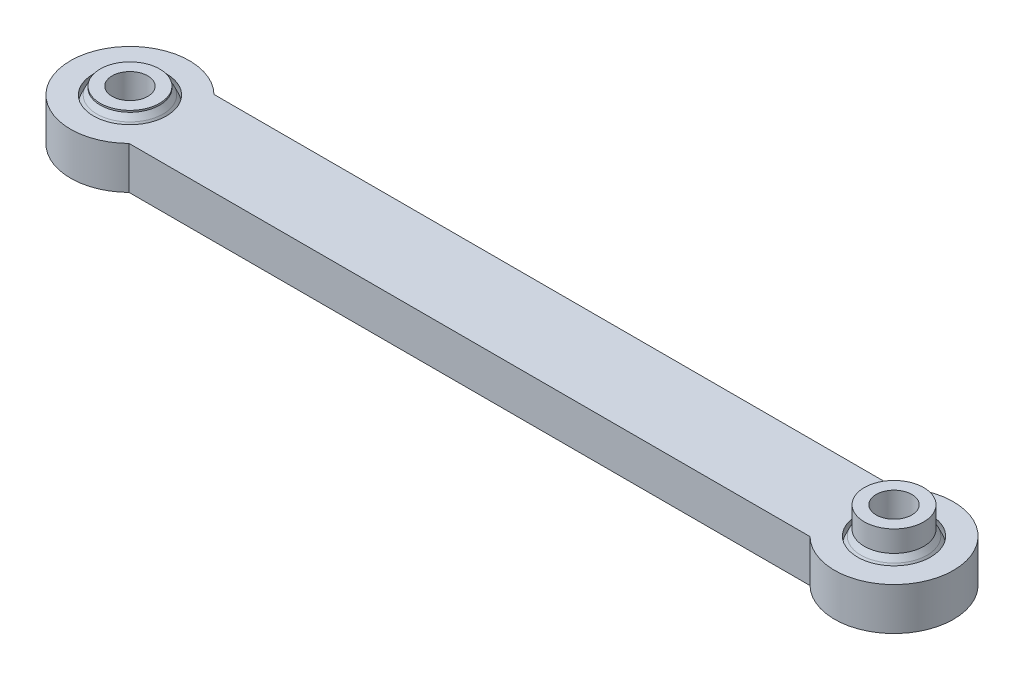
ISO-10303-21;
HEADER;
FILE_DESCRIPTION(('STEP AP214'),'2;1');
FILE_NAME('part.step','',(''),(''),'','','');
FILE_SCHEMA(('AUTOMOTIVE_DESIGN { 1 0 10303 214 1 1 1 1 }'));
ENDSEC;
DATA;
#1=APPLICATION_CONTEXT('core data for automotive mechanical design processes');
#2=APPLICATION_PROTOCOL_DEFINITION('international standard','automotive_design',2000,#1);
#3=PRODUCT_CONTEXT('',#1,'mechanical');
#4=PRODUCT('Part','Part','',(#3));
#5=PRODUCT_RELATED_PRODUCT_CATEGORY('part','',(#4));
#6=PRODUCT_DEFINITION_FORMATION('','',#4);
#7=PRODUCT_DEFINITION_CONTEXT('part definition',#1,'design');
#8=PRODUCT_DEFINITION('design','',#6,#7);
#9=PRODUCT_DEFINITION_SHAPE('','',#8);
#10=(LENGTH_UNIT() NAMED_UNIT(*) SI_UNIT(.MILLI.,.METRE.));
#11=(NAMED_UNIT(*) PLANE_ANGLE_UNIT() SI_UNIT($,.RADIAN.));
#12=(NAMED_UNIT(*) SI_UNIT($,.STERADIAN.) SOLID_ANGLE_UNIT());
#13=UNCERTAINTY_MEASURE_WITH_UNIT(LENGTH_MEASURE(1.E-05),#10,'distance_accuracy_value','');
#14=(GEOMETRIC_REPRESENTATION_CONTEXT(3) GLOBAL_UNCERTAINTY_ASSIGNED_CONTEXT((#13)) GLOBAL_UNIT_ASSIGNED_CONTEXT((#10,
#11,#12)) REPRESENTATION_CONTEXT('',''));
#15=CARTESIAN_POINT('',(0.,0.,0.));
#16=DIRECTION('',(0.,0.,1.));
#17=DIRECTION('',(1.,0.,0.));
#18=AXIS2_PLACEMENT_3D('',#15,#16,#17);
#19=CARTESIAN_POINT('',(45.,15.3455054986758,0.));
#20=DIRECTION('',(0.,1.,0.));
#21=DIRECTION('',(0.,0.,1.));
#22=AXIS2_PLACEMENT_3D('',#19,#20,#21);
#23=DEGENERATE_TOROIDAL_SURFACE('',#22,21.8682582480136,22.0876733945389,.T.);
#24=CARTESIAN_POINT('',(45.,2.5,0.));
#25=DIRECTION('',(0.,1.,0.));
#26=DIRECTION('',(0.,0.,1.));
#27=AXIS2_PLACEMENT_3D('',#24,#25,#26);
#28=CIRCLE('',#27,3.9);
#29=CARTESIAN_POINT('',(45.,2.5,3.9));
#30=VERTEX_POINT('',#29);
#31=EDGE_CURVE('E57',#30,#30,#28,.T.);
#32=ORIENTED_EDGE('',*,*,#31,.T.);
#33=EDGE_LOOP('',(#32));
#34=FACE_BOUND('',#33,.T.);
#35=CARTESIAN_POINT('',(45.,3.19999999999999,0.));
#36=DIRECTION('',(0.,-1.,0.));
#37=DIRECTION('',(0.,0.,-1.));
#38=AXIS2_PLACEMENT_3D('',#35,#36,#37);
#39=CIRCLE('',#38,3.41962653274933);
#40=CARTESIAN_POINT('',(45.,3.19999999999999,-3.41962653274933));
#41=VERTEX_POINT('',#40);
#42=EDGE_CURVE('E69',#41,#41,#39,.T.);
#43=ORIENTED_EDGE('',*,*,#42,.T.);
#44=EDGE_LOOP('',(#43));
#45=FACE_BOUND('',#44,.T.);
#46=ADVANCED_FACE('F47',(#34,#45),#23,.F.);
#47=CARTESIAN_POINT('',(45.,0.243502063584502,0.));
#48=DIRECTION('',(0.,1.,0.));
#49=DIRECTION('',(0.,0.,1.));
#50=AXIS2_PLACEMENT_3D('',#47,#48,#49);
#51=DEGENERATE_TOROIDAL_SURFACE('',#50,0.0062585982687352,4.50033388101411,.T.);
#52=CARTESIAN_POINT('',(45.,0.,0.));
#53=DIRECTION('',(0.,1.,0.));
#54=DIRECTION('',(0.,0.,1.));
#55=AXIS2_PLACEMENT_3D('',#52,#53,#54);
#56=CIRCLE('',#55,4.5);
#57=CARTESIAN_POINT('',(45.,0.,4.5));
#58=VERTEX_POINT('',#57);
#59=EDGE_CURVE('E53',#58,#58,#56,.T.);
#60=ORIENTED_EDGE('',*,*,#59,.T.);
#61=EDGE_LOOP('',(#60));
#62=FACE_BOUND('',#61,.T.);
#63=ORIENTED_EDGE('',*,*,#31,.F.);
#64=EDGE_LOOP('',(#63));
#65=FACE_BOUND('',#64,.T.);
#66=ADVANCED_FACE('F93',(#62,#65),#51,.T.);
#67=CARTESIAN_POINT('',(45.,-0.243502063584458,0.));
#68=DIRECTION('',(0.,1.,0.));
#69=DIRECTION('',(0.,0.,1.));
#70=AXIS2_PLACEMENT_3D('',#67,#68,#69);
#71=DEGENERATE_TOROIDAL_SURFACE('',#70,0.00625859826854092,4.50033388101431,.T.);
#72=CARTESIAN_POINT('',(45.,-2.5,0.));
#73=DIRECTION('',(0.,1.,0.));
#74=DIRECTION('',(0.,0.,1.));
#75=AXIS2_PLACEMENT_3D('',#72,#73,#74);
#76=CIRCLE('',#75,3.9);
#77=CARTESIAN_POINT('',(45.,-2.5,3.9));
#78=VERTEX_POINT('',#77);
#79=EDGE_CURVE('E11',#78,#78,#76,.T.);
#80=ORIENTED_EDGE('',*,*,#79,.T.);
#81=EDGE_LOOP('',(#80));
#82=FACE_BOUND('',#81,.T.);
#83=ORIENTED_EDGE('',*,*,#59,.F.);
#84=EDGE_LOOP('',(#83));
#85=FACE_BOUND('',#84,.T.);
#86=ADVANCED_FACE('F99',(#82,#85),#71,.T.);
#87=CARTESIAN_POINT('',(0.,-2.5,0.));
#88=DIRECTION('',(0.,1.,0.));
#89=DIRECTION('',(0.,0.,1.));
#90=AXIS2_PLACEMENT_3D('',#87,#88,#89);
#91=PLANE('',#90);
#92=CARTESIAN_POINT('',(45.,-2.5,0.));
#93=DIRECTION('',(0.,1.,0.));
#94=DIRECTION('',(0.,0.,1.));
#95=AXIS2_PLACEMENT_3D('',#92,#93,#94);
#96=CIRCLE('',#95,2.1);
#97=CARTESIAN_POINT('',(45.,-2.5,2.1));
#98=VERTEX_POINT('',#97);
#99=EDGE_CURVE('E61',#98,#98,#96,.T.);
#100=ORIENTED_EDGE('',*,*,#99,.T.);
#101=EDGE_LOOP('',(#100));
#102=FACE_BOUND('',#101,.T.);
#103=ORIENTED_EDGE('',*,*,#79,.F.);
#104=EDGE_LOOP('',(#103));
#105=FACE_BOUND('',#104,.T.);
#106=ADVANCED_FACE('F103',(#102,#105),#91,.F.);
#107=CARTESIAN_POINT('',(0.,5.69999999999999,0.));
#108=DIRECTION('',(0.,1.,0.));
#109=DIRECTION('',(0.,0.,1.));
#110=AXIS2_PLACEMENT_3D('',#107,#108,#109);
#111=PLANE('',#110);
#112=CARTESIAN_POINT('',(45.,5.69999999999999,0.));
#113=DIRECTION('',(0.,1.,0.));
#114=DIRECTION('',(0.,0.,1.));
#115=AXIS2_PLACEMENT_3D('',#112,#113,#114);
#116=CIRCLE('',#115,2.1);
#117=CARTESIAN_POINT('',(45.,5.69999999999999,2.1));
#118=VERTEX_POINT('',#117);
#119=EDGE_CURVE('E66',#118,#118,#116,.T.);
#120=ORIENTED_EDGE('',*,*,#119,.F.);
#121=EDGE_LOOP('',(#120));
#122=FACE_BOUND('',#121,.T.);
#123=CARTESIAN_POINT('',(45.,5.69999999999999,0.));
#124=DIRECTION('',(0.,1.,0.));
#125=DIRECTION('',(0.,0.,1.));
#126=AXIS2_PLACEMENT_3D('',#123,#124,#125);
#127=CIRCLE('',#126,3.5);
#128=CARTESIAN_POINT('',(45.,5.69999999999999,3.5));
#129=VERTEX_POINT('',#128);
#130=EDGE_CURVE('E73',#129,#129,#127,.T.);
#131=ORIENTED_EDGE('',*,*,#130,.T.);
#132=EDGE_LOOP('',(#131));
#133=FACE_BOUND('',#132,.T.);
#134=ADVANCED_FACE('F95',(#122,#133),#111,.T.);
#135=CARTESIAN_POINT('',(45.,-5.3,0.));
#136=DIRECTION('',(0.,1.,0.));
#137=DIRECTION('',(0.,0.,1.));
#138=AXIS2_PLACEMENT_3D('',#135,#136,#137);
#139=CYLINDRICAL_SURFACE('',#138,2.1);
#140=ORIENTED_EDGE('',*,*,#119,.T.);
#141=EDGE_LOOP('',(#140));
#142=FACE_BOUND('',#141,.T.);
#143=ORIENTED_EDGE('',*,*,#99,.F.);
#144=EDGE_LOOP('',(#143));
#145=FACE_BOUND('',#144,.T.);
#146=ADVANCED_FACE('F89',(#142,#145),#139,.F.);
#147=CARTESIAN_POINT('',(45.,3.19999999999999,0.));
#148=DIRECTION('',(0.,1.,0.));
#149=DIRECTION('',(0.,0.,1.));
#150=AXIS2_PLACEMENT_3D('',#147,#148,#149);
#151=CYLINDRICAL_SURFACE('',#150,3.5);
#152=CARTESIAN_POINT('',(45.,3.19999999999999,0.));
#153=DIRECTION('',(0.,1.,0.));
#154=DIRECTION('',(0.,0.,1.));
#155=AXIS2_PLACEMENT_3D('',#152,#153,#154);
#156=CIRCLE('',#155,3.5);
#157=CARTESIAN_POINT('',(45.,3.19999999999999,3.5));
#158=VERTEX_POINT('',#157);
#159=EDGE_CURVE('E72',#158,#158,#156,.T.);
#160=ORIENTED_EDGE('',*,*,#159,.T.);
#161=EDGE_LOOP('',(#160));
#162=FACE_BOUND('',#161,.T.);
#163=ORIENTED_EDGE('',*,*,#130,.F.);
#164=EDGE_LOOP('',(#163));
#165=FACE_BOUND('',#164,.T.);
#166=ADVANCED_FACE('F79',(#162,#165),#151,.T.);
#167=CARTESIAN_POINT('',(45.,3.19999999999999,0.));
#168=DIRECTION('',(0.,1.,0.));
#169=DIRECTION('',(0.,0.,1.));
#170=AXIS2_PLACEMENT_3D('',#167,#168,#169);
#171=PLANE('',#170);
#172=ORIENTED_EDGE('',*,*,#42,.F.);
#173=EDGE_LOOP('',(#172));
#174=FACE_BOUND('',#173,.T.);
#175=ORIENTED_EDGE('',*,*,#159,.F.);
#176=EDGE_LOOP('',(#175));
#177=FACE_BOUND('',#176,.T.);
#178=ADVANCED_FACE('F82',(#174,#177),#171,.F.);
#179=CLOSED_SHELL('',(#46,#66,#86,#106,#134,#146,#166,#178));
#180=MANIFOLD_SOLID_BREP('B2',#179);
#181=CARTESIAN_POINT('',(-45.,-5.3,0.));
#182=DIRECTION('',(0.,1.,0.));
#183=DIRECTION('',(0.,0.,1.));
#184=AXIS2_PLACEMENT_3D('',#181,#182,#183);
#185=CYLINDRICAL_SURFACE('',#184,2.1);
#186=CARTESIAN_POINT('',(-45.,-2.5,0.));
#187=DIRECTION('',(0.,-1.,0.));
#188=DIRECTION('',(0.,0.,-1.));
#189=AXIS2_PLACEMENT_3D('',#186,#187,#188);
#190=CIRCLE('',#189,2.1);
#191=CARTESIAN_POINT('',(-45.,-2.5,-2.1));
#192=VERTEX_POINT('',#191);
#193=EDGE_CURVE('E211',#192,#192,#190,.T.);
#194=ORIENTED_EDGE('',*,*,#193,.T.);
#195=EDGE_LOOP('',(#194));
#196=FACE_BOUND('',#195,.T.);
#197=CARTESIAN_POINT('',(-45.,3.4,0.));
#198=DIRECTION('',(0.,1.,0.));
#199=DIRECTION('',(0.,0.,1.));
#200=AXIS2_PLACEMENT_3D('',#197,#198,#199);
#201=CIRCLE('',#200,2.1);
#202=CARTESIAN_POINT('',(-45.,3.4,2.1));
#203=VERTEX_POINT('',#202);
#204=EDGE_CURVE('E223',#203,#203,#201,.F.);
#205=ORIENTED_EDGE('',*,*,#204,.F.);
#206=EDGE_LOOP('',(#205));
#207=FACE_BOUND('',#206,.T.);
#208=ADVANCED_FACE('F195',(#196,#207),#185,.F.);
#209=CARTESIAN_POINT('',(-45.,3.19999999999999,0.));
#210=DIRECTION('',(0.,1.,0.));
#211=DIRECTION('',(0.,0.,1.));
#212=AXIS2_PLACEMENT_3D('',#209,#210,#211);
#213=CYLINDRICAL_SURFACE('',#212,3.5);
#214=CARTESIAN_POINT('',(-45.,3.19999999999999,0.));
#215=DIRECTION('',(0.,1.,0.));
#216=DIRECTION('',(0.,0.,1.));
#217=AXIS2_PLACEMENT_3D('',#214,#215,#216);
#218=CIRCLE('',#217,3.5);
#219=CARTESIAN_POINT('',(-45.,3.19999999999999,3.5));
#220=VERTEX_POINT('',#219);
#221=EDGE_CURVE('E218',#220,#220,#218,.T.);
#222=ORIENTED_EDGE('',*,*,#221,.T.);
#223=EDGE_LOOP('',(#222));
#224=FACE_BOUND('',#223,.T.);
#225=CARTESIAN_POINT('',(-45.,3.4,0.));
#226=DIRECTION('',(0.,1.,0.));
#227=DIRECTION('',(0.,0.,1.));
#228=AXIS2_PLACEMENT_3D('',#225,#226,#227);
#229=CIRCLE('',#228,3.5);
#230=CARTESIAN_POINT('',(-45.,3.4,3.5));
#231=VERTEX_POINT('',#230);
#232=EDGE_CURVE('E199',#231,#231,#229,.F.);
#233=ORIENTED_EDGE('',*,*,#232,.T.);
#234=EDGE_LOOP('',(#233));
#235=FACE_BOUND('',#234,.T.);
#236=ADVANCED_FACE('F232',(#224,#235),#213,.T.);
#237=CARTESIAN_POINT('',(-45.,15.3455054986679,0.));
#238=DIRECTION('',(0.,-1.,0.));
#239=DIRECTION('',(0.,0.,-1.));
#240=AXIS2_PLACEMENT_3D('',#237,#238,#239);
#241=DEGENERATE_TOROIDAL_SURFACE('',#240,21.8682582480017,22.0876733945246,.T.);
#242=CARTESIAN_POINT('',(-45.,2.5,0.));
#243=DIRECTION('',(0.,-1.,0.));
#244=DIRECTION('',(0.,0.,-1.));
#245=AXIS2_PLACEMENT_3D('',#242,#243,#244);
#246=CIRCLE('',#245,3.9);
#247=CARTESIAN_POINT('',(-45.,2.5,-3.9));
#248=VERTEX_POINT('',#247);
#249=EDGE_CURVE('E46',#248,#248,#246,.T.);
#250=ORIENTED_EDGE('',*,*,#249,.F.);
#251=EDGE_LOOP('',(#250));
#252=FACE_BOUND('',#251,.T.);
#253=CARTESIAN_POINT('',(-45.,3.19999999999999,0.));
#254=DIRECTION('',(0.,-1.,0.));
#255=DIRECTION('',(0.,0.,-1.));
#256=AXIS2_PLACEMENT_3D('',#253,#254,#255);
#257=CIRCLE('',#256,3.41962653274932);
#258=CARTESIAN_POINT('',(-45.,3.19999999999999,-3.41962653274932));
#259=VERTEX_POINT('',#258);
#260=EDGE_CURVE('E213',#259,#259,#257,.T.);
#261=ORIENTED_EDGE('',*,*,#260,.T.);
#262=EDGE_LOOP('',(#261));
#263=FACE_BOUND('',#262,.T.);
#264=ADVANCED_FACE('F197',(#252,#263),#241,.F.);
#265=CARTESIAN_POINT('',(-45.,-0.243502063584499,0.));
#266=DIRECTION('',(0.,-1.,0.));
#267=DIRECTION('',(0.,0.,-1.));
#268=AXIS2_PLACEMENT_3D('',#265,#266,#267);
#269=DEGENERATE_TOROIDAL_SURFACE('',#268,0.00625859826871439,4.50033388101413,.T.);
#270=CARTESIAN_POINT('',(-45.,0.,0.));
#271=DIRECTION('',(0.,-1.,0.));
#272=DIRECTION('',(0.,0.,-1.));
#273=AXIS2_PLACEMENT_3D('',#270,#271,#272);
#274=CIRCLE('',#273,4.5);
#275=CARTESIAN_POINT('',(-45.,0.,-4.5));
#276=VERTEX_POINT('',#275);
#277=EDGE_CURVE('E203',#276,#276,#274,.T.);
#278=ORIENTED_EDGE('',*,*,#277,.T.);
#279=EDGE_LOOP('',(#278));
#280=FACE_BOUND('',#279,.T.);
#281=CARTESIAN_POINT('',(-45.,-2.5,0.));
#282=DIRECTION('',(0.,-1.,0.));
#283=DIRECTION('',(0.,0.,-1.));
#284=AXIS2_PLACEMENT_3D('',#281,#282,#283);
#285=CIRCLE('',#284,3.9);
#286=CARTESIAN_POINT('',(-45.,-2.5,-3.9));
#287=VERTEX_POINT('',#286);
#288=EDGE_CURVE('E208',#287,#287,#285,.T.);
#289=ORIENTED_EDGE('',*,*,#288,.F.);
#290=EDGE_LOOP('',(#289));
#291=FACE_BOUND('',#290,.T.);
#292=ADVANCED_FACE('F256',(#280,#291),#269,.T.);
#293=CARTESIAN_POINT('',(0.,-2.5,0.));
#294=DIRECTION('',(0.,-1.,0.));
#295=DIRECTION('',(0.,0.,-1.));
#296=AXIS2_PLACEMENT_3D('',#293,#294,#295);
#297=PLANE('',#296);
#298=ORIENTED_EDGE('',*,*,#193,.F.);
#299=EDGE_LOOP('',(#298));
#300=FACE_BOUND('',#299,.T.);
#301=ORIENTED_EDGE('',*,*,#288,.T.);
#302=EDGE_LOOP('',(#301));
#303=FACE_BOUND('',#302,.T.);
#304=ADVANCED_FACE('F253',(#300,#303),#297,.T.);
#305=CARTESIAN_POINT('',(-45.,0.243502063584498,0.));
#306=DIRECTION('',(0.,-1.,0.));
#307=DIRECTION('',(0.,0.,-1.));
#308=AXIS2_PLACEMENT_3D('',#305,#306,#307);
#309=DEGENERATE_TOROIDAL_SURFACE('',#308,0.00625859826871439,4.50033388101413,.T.);
#310=ORIENTED_EDGE('',*,*,#277,.F.);
#311=EDGE_LOOP('',(#310));
#312=FACE_BOUND('',#311,.T.);
#313=ORIENTED_EDGE('',*,*,#249,.T.);
#314=EDGE_LOOP('',(#313));
#315=FACE_BOUND('',#314,.T.);
#316=ADVANCED_FACE('F241',(#312,#315),#309,.T.);
#317=CARTESIAN_POINT('',(-45.,3.19999999999999,0.));
#318=DIRECTION('',(0.,1.,0.));
#319=DIRECTION('',(0.,0.,1.));
#320=AXIS2_PLACEMENT_3D('',#317,#318,#319);
#321=PLANE('',#320);
#322=ORIENTED_EDGE('',*,*,#260,.F.);
#323=EDGE_LOOP('',(#322));
#324=FACE_BOUND('',#323,.T.);
#325=ORIENTED_EDGE('',*,*,#221,.F.);
#326=EDGE_LOOP('',(#325));
#327=FACE_BOUND('',#326,.T.);
#328=ADVANCED_FACE('F236',(#324,#327),#321,.F.);
#329=CARTESIAN_POINT('',(-45.,3.4,0.));
#330=DIRECTION('',(0.,1.,0.));
#331=DIRECTION('',(0.,0.,1.));
#332=AXIS2_PLACEMENT_3D('',#329,#330,#331);
#333=PLANE('',#332);
#334=ORIENTED_EDGE('',*,*,#232,.F.);
#335=EDGE_LOOP('',(#334));
#336=FACE_BOUND('',#335,.T.);
#337=ORIENTED_EDGE('',*,*,#204,.T.);
#338=EDGE_LOOP('',(#337));
#339=FACE_BOUND('',#338,.T.);
#340=ADVANCED_FACE('F234',(#336,#339),#333,.T.);
#341=CLOSED_SHELL('',(#208,#236,#264,#292,#304,#316,#328,#340));
#342=MANIFOLD_SOLID_BREP('B6',#341);
#343=CARTESIAN_POINT('',(-45.,0.,0.));
#344=DIRECTION('',(0.,-1.,0.));
#345=DIRECTION('',(-1.,0.,0.));
#346=AXIS2_PLACEMENT_3D('',#343,#344,#345);
#347=SPHERICAL_SURFACE('',#346,4.97393204617835);
#348=CARTESIAN_POINT('',(-45.,-2.5,0.));
#349=DIRECTION('',(0.,-1.,0.));
#350=DIRECTION('',(0.,0.,-1.));
#351=AXIS2_PLACEMENT_3D('',#348,#349,#350);
#352=CIRCLE('',#351,4.3);
#353=CARTESIAN_POINT('',(-45.,-2.5,-4.3));
#354=VERTEX_POINT('',#353);
#355=EDGE_CURVE('E402',#354,#354,#352,.T.);
#356=ORIENTED_EDGE('',*,*,#355,.T.);
#357=EDGE_LOOP('',(#356));
#358=FACE_BOUND('',#357,.T.);
#359=CARTESIAN_POINT('',(-45.,2.5,0.));
#360=DIRECTION('',(0.,-1.,0.));
#361=DIRECTION('',(0.,0.,-1.));
#362=AXIS2_PLACEMENT_3D('',#359,#360,#361);
#363=CIRCLE('',#362,4.3);
#364=CARTESIAN_POINT('',(-45.,2.5,-4.3));
#365=VERTEX_POINT('',#364);
#366=EDGE_CURVE('E193',#365,#365,#363,.T.);
#367=ORIENTED_EDGE('',*,*,#366,.F.);
#368=EDGE_LOOP('',(#367));
#369=FACE_BOUND('',#368,.T.);
#370=ADVANCED_FACE('F328',(#358,#369),#347,.F.);
#371=CARTESIAN_POINT('',(0.,2.5,0.));
#372=DIRECTION('',(0.,-1.,0.));
#373=DIRECTION('',(0.,0.,-1.));
#374=AXIS2_PLACEMENT_3D('',#371,#372,#373);
#375=PLANE('',#374);
#376=DIRECTION('',(1.,0.,0.));
#377=VECTOR('',#376,1.);
#378=CARTESIAN_POINT('',(40.1010205144336,2.5,5.));
#379=LINE('',#378,#377);
#380=CARTESIAN_POINT('',(-40.1010205144336,2.5,5.));
#381=VERTEX_POINT('',#380);
#382=CARTESIAN_POINT('',(40.1010205144336,2.5,5.));
#383=VERTEX_POINT('',#382);
#384=EDGE_CURVE('E393',#381,#383,#379,.T.);
#385=ORIENTED_EDGE('',*,*,#384,.T.);
#386=CARTESIAN_POINT('',(45.,2.5,0.));
#387=DIRECTION('',(0.,-1.,0.));
#388=DIRECTION('',(0.,0.,-1.));
#389=AXIS2_PLACEMENT_3D('',#386,#387,#388);
#390=CIRCLE('',#389,7.);
#391=CARTESIAN_POINT('',(40.1010205144336,2.5,-5.));
#392=VERTEX_POINT('',#391);
#393=EDGE_CURVE('E371',#392,#383,#390,.T.);
#394=ORIENTED_EDGE('',*,*,#393,.F.);
#395=DIRECTION('',(-1.,0.,0.));
#396=VECTOR('',#395,1.);
#397=CARTESIAN_POINT('',(-40.1010205144336,2.5,-5.));
#398=LINE('',#397,#396);
#399=CARTESIAN_POINT('',(-40.1010205144336,2.5,-5.));
#400=VERTEX_POINT('',#399);
#401=EDGE_CURVE('E397',#392,#400,#398,.T.);
#402=ORIENTED_EDGE('',*,*,#401,.T.);
#403=CARTESIAN_POINT('',(-45.,2.5,0.));
#404=DIRECTION('',(0.,-1.,0.));
#405=DIRECTION('',(0.,0.,-1.));
#406=AXIS2_PLACEMENT_3D('',#403,#404,#405);
#407=CIRCLE('',#406,7.);
#408=EDGE_CURVE('E335',#381,#400,#407,.T.);
#409=ORIENTED_EDGE('',*,*,#408,.F.);
#410=EDGE_LOOP('',(#385,#394,#402,#409));
#411=FACE_BOUND('',#410,.T.);
#412=ORIENTED_EDGE('',*,*,#366,.T.);
#413=EDGE_LOOP('',(#412));
#414=FACE_BOUND('',#413,.T.);
#415=CARTESIAN_POINT('',(45.,2.5,0.));
#416=DIRECTION('',(0.,-1.,0.));
#417=DIRECTION('',(0.,0.,-1.));
#418=AXIS2_PLACEMENT_3D('',#415,#416,#417);
#419=CIRCLE('',#418,4.3);
#420=CARTESIAN_POINT('',(45.,2.5,-4.3));
#421=VERTEX_POINT('',#420);
#422=EDGE_CURVE('E400',#421,#421,#419,.T.);
#423=ORIENTED_EDGE('',*,*,#422,.T.);
#424=EDGE_LOOP('',(#423));
#425=FACE_BOUND('',#424,.T.);
#426=ADVANCED_FACE('F411',(#411,#414,#425),#375,.F.);
#427=CARTESIAN_POINT('',(-45.,-2.50000000000001,0.));
#428=DIRECTION('',(0.,-1.,0.));
#429=DIRECTION('',(0.,0.,-1.));
#430=AXIS2_PLACEMENT_3D('',#427,#428,#429);
#431=CYLINDRICAL_SURFACE('',#430,7.);
#432=CARTESIAN_POINT('',(-45.,-2.5,0.));
#433=DIRECTION('',(0.,-1.,0.));
#434=DIRECTION('',(0.,0.,-1.));
#435=AXIS2_PLACEMENT_3D('',#432,#433,#434);
#436=CIRCLE('',#435,7.);
#437=CARTESIAN_POINT('',(-40.1010205144336,-2.5,5.));
#438=VERTEX_POINT('',#437);
#439=CARTESIAN_POINT('',(-40.1010205144336,-2.5,-5.));
#440=VERTEX_POINT('',#439);
#441=EDGE_CURVE('E346',#438,#440,#436,.T.);
#442=ORIENTED_EDGE('',*,*,#441,.F.);
#443=DIRECTION('',(0.,1.,0.));
#444=VECTOR('',#443,1.);
#445=CARTESIAN_POINT('',(-40.1010205144336,-2.5,5.));
#446=LINE('',#445,#444);
#447=EDGE_CURVE('E377',#438,#381,#446,.T.);
#448=ORIENTED_EDGE('',*,*,#447,.T.);
#449=ORIENTED_EDGE('',*,*,#408,.T.);
#450=DIRECTION('',(0.,1.,0.));
#451=VECTOR('',#450,1.);
#452=CARTESIAN_POINT('',(-40.1010205144336,-2.5,-5.));
#453=LINE('',#452,#451);
#454=EDGE_CURVE('E390',#440,#400,#453,.T.);
#455=ORIENTED_EDGE('',*,*,#454,.F.);
#456=EDGE_LOOP('',(#442,#448,#449,#455));
#457=FACE_BOUND('',#456,.T.);
#458=ADVANCED_FACE('F435',(#457),#431,.T.);
#459=CARTESIAN_POINT('',(0.,-2.5,0.));
#460=DIRECTION('',(0.,-1.,0.));
#461=DIRECTION('',(0.,0.,-1.));
#462=AXIS2_PLACEMENT_3D('',#459,#460,#461);
#463=PLANE('',#462);
#464=DIRECTION('',(-1.,0.,0.));
#465=VECTOR('',#464,1.);
#466=CARTESIAN_POINT('',(-40.1010205144336,-2.5,-5.));
#467=LINE('',#466,#465);
#468=CARTESIAN_POINT('',(40.1010205144336,-2.5,-5.));
#469=VERTEX_POINT('',#468);
#470=EDGE_CURVE('E386',#469,#440,#467,.T.);
#471=ORIENTED_EDGE('',*,*,#470,.F.);
#472=CARTESIAN_POINT('',(45.,-2.5,0.));
#473=DIRECTION('',(0.,-1.,0.));
#474=DIRECTION('',(0.,0.,-1.));
#475=AXIS2_PLACEMENT_3D('',#472,#473,#474);
#476=CIRCLE('',#475,7.);
#477=CARTESIAN_POINT('',(40.1010205144336,-2.5,5.));
#478=VERTEX_POINT('',#477);
#479=EDGE_CURVE('E368',#469,#478,#476,.T.);
#480=ORIENTED_EDGE('',*,*,#479,.T.);
#481=DIRECTION('',(1.,0.,0.));
#482=VECTOR('',#481,1.);
#483=CARTESIAN_POINT('',(40.1010205144336,-2.5,5.));
#484=LINE('',#483,#482);
#485=EDGE_CURVE('E384',#438,#478,#484,.T.);
#486=ORIENTED_EDGE('',*,*,#485,.F.);
#487=ORIENTED_EDGE('',*,*,#441,.T.);
#488=EDGE_LOOP('',(#471,#480,#486,#487));
#489=FACE_BOUND('',#488,.T.);
#490=ORIENTED_EDGE('',*,*,#355,.F.);
#491=EDGE_LOOP('',(#490));
#492=FACE_BOUND('',#491,.T.);
#493=CARTESIAN_POINT('',(45.,-2.5,0.));
#494=DIRECTION('',(0.,-1.,0.));
#495=DIRECTION('',(0.,0.,-1.));
#496=AXIS2_PLACEMENT_3D('',#493,#494,#495);
#497=CIRCLE('',#496,4.3);
#498=CARTESIAN_POINT('',(45.,-2.5,-4.3));
#499=VERTEX_POINT('',#498);
#500=EDGE_CURVE('E387',#499,#499,#497,.T.);
#501=ORIENTED_EDGE('',*,*,#500,.F.);
#502=EDGE_LOOP('',(#501));
#503=FACE_BOUND('',#502,.T.);
#504=ADVANCED_FACE('F382',(#489,#492,#503),#463,.T.);
#505=CARTESIAN_POINT('',(-40.1010205144336,-2.5,-5.));
#506=DIRECTION('',(0.,0.,-1.));
#507=DIRECTION('',(-1.,0.,0.));
#508=AXIS2_PLACEMENT_3D('',#505,#506,#507);
#509=PLANE('',#508);
#510=ORIENTED_EDGE('',*,*,#401,.F.);
#511=DIRECTION('',(0.,1.,0.));
#512=VECTOR('',#511,1.);
#513=CARTESIAN_POINT('',(40.1010205144336,-2.5,-5.));
#514=LINE('',#513,#512);
#515=EDGE_CURVE('E376',#469,#392,#514,.T.);
#516=ORIENTED_EDGE('',*,*,#515,.F.);
#517=ORIENTED_EDGE('',*,*,#470,.T.);
#518=ORIENTED_EDGE('',*,*,#454,.T.);
#519=EDGE_LOOP('',(#510,#516,#517,#518));
#520=FACE_BOUND('',#519,.T.);
#521=ADVANCED_FACE('F409',(#520),#509,.T.);
#522=CARTESIAN_POINT('',(40.1010205144336,-2.5,5.));
#523=DIRECTION('',(0.,0.,1.));
#524=DIRECTION('',(1.,0.,0.));
#525=AXIS2_PLACEMENT_3D('',#522,#523,#524);
#526=PLANE('',#525);
#527=ORIENTED_EDGE('',*,*,#384,.F.);
#528=ORIENTED_EDGE('',*,*,#447,.F.);
#529=ORIENTED_EDGE('',*,*,#485,.T.);
#530=DIRECTION('',(0.,1.,0.));
#531=VECTOR('',#530,1.);
#532=CARTESIAN_POINT('',(40.1010205144336,-2.5,5.));
#533=LINE('',#532,#531);
#534=EDGE_CURVE('E365',#478,#383,#533,.T.);
#535=ORIENTED_EDGE('',*,*,#534,.T.);
#536=EDGE_LOOP('',(#527,#528,#529,#535));
#537=FACE_BOUND('',#536,.T.);
#538=ADVANCED_FACE('F389',(#537),#526,.T.);
#539=CARTESIAN_POINT('',(45.,0.,0.));
#540=DIRECTION('',(0.,-1.,0.));
#541=DIRECTION('',(1.,0.,0.));
#542=AXIS2_PLACEMENT_3D('',#539,#540,#541);
#543=SPHERICAL_SURFACE('',#542,4.97393204617835);
#544=ORIENTED_EDGE('',*,*,#500,.T.);
#545=EDGE_LOOP('',(#544));
#546=FACE_BOUND('',#545,.T.);
#547=ORIENTED_EDGE('',*,*,#422,.F.);
#548=EDGE_LOOP('',(#547));
#549=FACE_BOUND('',#548,.T.);
#550=ADVANCED_FACE('F420',(#546,#549),#543,.F.);
#551=CARTESIAN_POINT('',(45.,-2.49999999999999,0.));
#552=DIRECTION('',(0.,-1.,0.));
#553=DIRECTION('',(0.,0.,-1.));
#554=AXIS2_PLACEMENT_3D('',#551,#552,#553);
#555=CYLINDRICAL_SURFACE('',#554,7.);
#556=ORIENTED_EDGE('',*,*,#515,.T.);
#557=ORIENTED_EDGE('',*,*,#393,.T.);
#558=ORIENTED_EDGE('',*,*,#534,.F.);
#559=ORIENTED_EDGE('',*,*,#479,.F.);
#560=EDGE_LOOP('',(#556,#557,#558,#559));
#561=FACE_BOUND('',#560,.T.);
#562=ADVANCED_FACE('F367',(#561),#555,.T.);
#563=CLOSED_SHELL('',(#370,#426,#458,#504,#521,#538,#550,#562));
#564=MANIFOLD_SOLID_BREP('B41',#563);
#565=ADVANCED_BREP_SHAPE_REPRESENTATION('',(#18,#180,#342,#564),#14);
#566=SHAPE_DEFINITION_REPRESENTATION(#9,#565);
ENDSEC;
END-ISO-10303-21;
